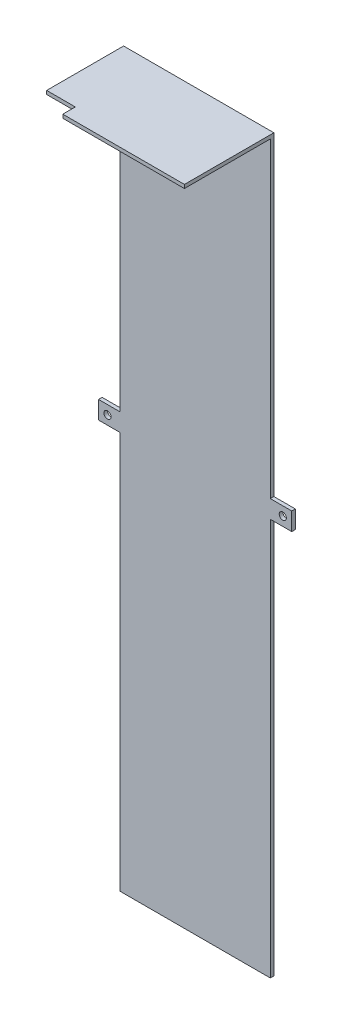
ISO-10303-21;
HEADER;
FILE_DESCRIPTION(('STEP AP214'),'2;1');
FILE_NAME('part.step','',(''),(''),'','','');
FILE_SCHEMA(('AUTOMOTIVE_DESIGN { 1 0 10303 214 1 1 1 1 }'));
ENDSEC;
DATA;
#1=APPLICATION_CONTEXT('core data for automotive mechanical design processes');
#2=APPLICATION_PROTOCOL_DEFINITION('international standard','automotive_design',2000,#1);
#3=PRODUCT_CONTEXT('',#1,'mechanical');
#4=PRODUCT('Part','Part','',(#3));
#5=PRODUCT_RELATED_PRODUCT_CATEGORY('part','',(#4));
#6=PRODUCT_DEFINITION_FORMATION('','',#4);
#7=PRODUCT_DEFINITION_CONTEXT('part definition',#1,'design');
#8=PRODUCT_DEFINITION('design','',#6,#7);
#9=PRODUCT_DEFINITION_SHAPE('','',#8);
#10=(LENGTH_UNIT() NAMED_UNIT(*) SI_UNIT(.MILLI.,.METRE.));
#11=(NAMED_UNIT(*) PLANE_ANGLE_UNIT() SI_UNIT($,.RADIAN.));
#12=(NAMED_UNIT(*) SI_UNIT($,.STERADIAN.) SOLID_ANGLE_UNIT());
#13=UNCERTAINTY_MEASURE_WITH_UNIT(LENGTH_MEASURE(1.E-05),#10,'distance_accuracy_value','');
#14=(GEOMETRIC_REPRESENTATION_CONTEXT(3) GLOBAL_UNCERTAINTY_ASSIGNED_CONTEXT((#13)) GLOBAL_UNIT_ASSIGNED_CONTEXT((#10,
#11,#12)) REPRESENTATION_CONTEXT('',''));
#15=CARTESIAN_POINT('',(0.,0.,0.));
#16=DIRECTION('',(0.,0.,1.));
#17=DIRECTION('',(1.,0.,0.));
#18=AXIS2_PLACEMENT_3D('',#15,#16,#17);
#19=CARTESIAN_POINT('',(-16.6842105263158,1.,-5.73684210526316));
#20=DIRECTION('',(1.,0.,0.));
#21=DIRECTION('',(0.,0.,-1.));
#22=AXIS2_PLACEMENT_3D('',#19,#20,#21);
#23=PLANE('',#22);
#24=DIRECTION('',(0.,-1.,0.));
#25=VECTOR('',#24,1.);
#26=CARTESIAN_POINT('',(-16.6842105263158,1.,-5.73684210526316));
#27=LINE('',#26,#25);
#28=CARTESIAN_POINT('',(-16.6842105263158,1.,-5.73684210526316));
#29=VERTEX_POINT('',#28);
#30=CARTESIAN_POINT('',(-16.6842105263158,-87.05,-5.73684210526316));
#31=VERTEX_POINT('',#30);
#32=EDGE_CURVE('E163',#29,#31,#27,.T.);
#33=ORIENTED_EDGE('',*,*,#32,.T.);
#34=DIRECTION('',(0.,0.,1.));
#35=VECTOR('',#34,1.);
#36=CARTESIAN_POINT('',(-16.6842105263158,-87.05,-5.73684210526316));
#37=LINE('',#36,#35);
#38=CARTESIAN_POINT('',(-16.6842105263158,-87.05,-4.73684210526315));
#39=VERTEX_POINT('',#38);
#40=EDGE_CURVE('E59',#31,#39,#37,.T.);
#41=ORIENTED_EDGE('',*,*,#40,.T.);
#42=DIRECTION('',(0.,1.,0.));
#43=VECTOR('',#42,1.);
#44=CARTESIAN_POINT('',(-16.6842105263158,-178.,-4.73684210526315));
#45=LINE('',#44,#43);
#46=CARTESIAN_POINT('',(-16.6842105263158,0.,-4.73684210526315));
#47=VERTEX_POINT('',#46);
#48=EDGE_CURVE('E287',#39,#47,#45,.T.);
#49=ORIENTED_EDGE('',*,*,#48,.T.);
#50=DIRECTION('',(0.,0.,1.));
#51=VECTOR('',#50,1.);
#52=CARTESIAN_POINT('',(-16.6842105263158,0.,-5.73684210526316));
#53=LINE('',#52,#51);
#54=CARTESIAN_POINT('',(-16.6842105263158,0.,15.7631578947368));
#55=VERTEX_POINT('',#54);
#56=EDGE_CURVE('E297',#47,#55,#53,.T.);
#57=ORIENTED_EDGE('',*,*,#56,.T.);
#58=DIRECTION('',(0.,1.,0.));
#59=VECTOR('',#58,1.);
#60=CARTESIAN_POINT('',(-16.6842105263158,-14.,15.7631578947368));
#61=LINE('',#60,#59);
#62=CARTESIAN_POINT('',(-16.6842105263158,1.,15.7631578947368));
#63=VERTEX_POINT('',#62);
#64=EDGE_CURVE('E283',#55,#63,#61,.T.);
#65=ORIENTED_EDGE('',*,*,#64,.T.);
#66=DIRECTION('',(0.,0.,1.));
#67=VECTOR('',#66,1.);
#68=CARTESIAN_POINT('',(-16.6842105263158,1.,-5.73684210526316));
#69=LINE('',#68,#67);
#70=EDGE_CURVE('E301',#29,#63,#69,.T.);
#71=ORIENTED_EDGE('',*,*,#70,.F.);
#72=EDGE_LOOP('',(#33,#41,#49,#57,#65,#71));
#73=FACE_BOUND('',#72,.T.);
#74=ADVANCED_FACE('F43',(#73),#23,.F.);
#75=CARTESIAN_POINT('',(25.3157894736842,1.,-5.73684210526316));
#76=DIRECTION('',(-1.,0.,0.));
#77=DIRECTION('',(0.,0.,1.));
#78=AXIS2_PLACEMENT_3D('',#75,#76,#77);
#79=PLANE('',#78);
#80=DIRECTION('',(0.,0.,-1.));
#81=VECTOR('',#80,1.);
#82=CARTESIAN_POINT('',(25.3157894736842,-92.05,-4.73684210526316));
#83=LINE('',#82,#81);
#84=CARTESIAN_POINT('',(25.3157894736842,-92.05,-4.73684210526316));
#85=VERTEX_POINT('',#84);
#86=CARTESIAN_POINT('',(25.3157894736842,-92.05,-5.73684210526316));
#87=VERTEX_POINT('',#86);
#88=EDGE_CURVE('E263',#85,#87,#83,.T.);
#89=ORIENTED_EDGE('',*,*,#88,.F.);
#90=DIRECTION('',(0.,1.,0.));
#91=VECTOR('',#90,1.);
#92=CARTESIAN_POINT('',(25.3157894736842,-178.,-4.73684210526316));
#93=LINE('',#92,#91);
#94=CARTESIAN_POINT('',(25.3157894736842,-203.1,-4.73684210526315));
#95=VERTEX_POINT('',#94);
#96=EDGE_CURVE('E293',#95,#85,#93,.T.);
#97=ORIENTED_EDGE('',*,*,#96,.F.);
#98=DIRECTION('',(0.,0.,1.));
#99=VECTOR('',#98,1.);
#100=CARTESIAN_POINT('',(25.3157894736842,-203.1,-5.73684210526316));
#101=LINE('',#100,#99);
#102=CARTESIAN_POINT('',(25.3157894736842,-203.1,-5.73684210526316));
#103=VERTEX_POINT('',#102);
#104=EDGE_CURVE('E177',#103,#95,#101,.T.);
#105=ORIENTED_EDGE('',*,*,#104,.F.);
#106=DIRECTION('',(0.,-1.,0.));
#107=VECTOR('',#106,1.);
#108=CARTESIAN_POINT('',(25.3157894736842,1.,-5.73684210526316));
#109=LINE('',#108,#107);
#110=EDGE_CURVE('E172',#87,#103,#109,.T.);
#111=ORIENTED_EDGE('',*,*,#110,.F.);
#112=EDGE_LOOP('',(#89,#97,#105,#111));
#113=FACE_BOUND('',#112,.T.);
#114=ADVANCED_FACE('F383',(#113),#79,.F.);
#115=CARTESIAN_POINT('',(25.3157894736842,-178.,-4.73684210526316));
#116=DIRECTION('',(0.,0.,1.));
#117=DIRECTION('',(1.,0.,0.));
#118=AXIS2_PLACEMENT_3D('',#115,#116,#117);
#119=PLANE('',#118);
#120=DIRECTION('',(-1.,0.,0.));
#121=VECTOR('',#120,1.);
#122=CARTESIAN_POINT('',(-16.6842105263158,-203.1,-4.73684210526315));
#123=LINE('',#122,#121);
#124=CARTESIAN_POINT('',(-16.6842105263158,-203.1,-4.73684210526315));
#125=VERTEX_POINT('',#124);
#126=EDGE_CURVE('E182',#95,#125,#123,.T.);
#127=ORIENTED_EDGE('',*,*,#126,.F.);
#128=ORIENTED_EDGE('',*,*,#96,.T.);
#129=DIRECTION('',(-1.,0.,0.));
#130=VECTOR('',#129,1.);
#131=CARTESIAN_POINT('',(25.3157894736842,-92.05,-4.73684210526316));
#132=LINE('',#131,#130);
#133=CARTESIAN_POINT('',(31.3157894736842,-92.05,-4.73684210526316));
#134=VERTEX_POINT('',#133);
#135=EDGE_CURVE('E250',#134,#85,#132,.T.);
#136=ORIENTED_EDGE('',*,*,#135,.F.);
#137=DIRECTION('',(0.,-1.,0.));
#138=VECTOR('',#137,1.);
#139=CARTESIAN_POINT('',(31.3157894736842,-92.05,-4.73684210526316));
#140=LINE('',#139,#138);
#141=CARTESIAN_POINT('',(31.3157894736842,-87.05,-4.73684210526316));
#142=VERTEX_POINT('',#141);
#143=EDGE_CURVE('E245',#142,#134,#140,.T.);
#144=ORIENTED_EDGE('',*,*,#143,.F.);
#145=DIRECTION('',(1.,0.,0.));
#146=VECTOR('',#145,1.);
#147=CARTESIAN_POINT('',(25.3157894736842,-87.05,-4.73684210526316));
#148=LINE('',#147,#146);
#149=CARTESIAN_POINT('',(25.3157894736842,-87.05,-4.73684210526316));
#150=VERTEX_POINT('',#149);
#151=EDGE_CURVE('E241',#150,#142,#148,.T.);
#152=ORIENTED_EDGE('',*,*,#151,.F.);
#153=CARTESIAN_POINT('',(25.3157894736842,0.,-4.73684210526316));
#154=VERTEX_POINT('',#153);
#155=EDGE_CURVE('E298',#150,#154,#93,.T.);
#156=ORIENTED_EDGE('',*,*,#155,.T.);
#157=DIRECTION('',(1.,0.,0.));
#158=VECTOR('',#157,1.);
#159=CARTESIAN_POINT('',(0.,0.,-4.73684210526315));
#160=LINE('',#159,#158);
#161=EDGE_CURVE('E332',#47,#154,#160,.T.);
#162=ORIENTED_EDGE('',*,*,#161,.F.);
#163=ORIENTED_EDGE('',*,*,#48,.F.);
#164=DIRECTION('',(1.,0.,0.));
#165=VECTOR('',#164,1.);
#166=CARTESIAN_POINT('',(31.3157894736842,-87.05,-4.73684210526316));
#167=LINE('',#166,#165);
#168=CARTESIAN_POINT('',(-22.6842105263158,-87.05,-4.73684210526315));
#169=VERTEX_POINT('',#168);
#170=EDGE_CURVE('E226',#169,#39,#167,.T.);
#171=ORIENTED_EDGE('',*,*,#170,.F.);
#172=DIRECTION('',(0.,1.,0.));
#173=VECTOR('',#172,1.);
#174=CARTESIAN_POINT('',(-22.6842105263158,-87.05,-4.73684210526315));
#175=LINE('',#174,#173);
#176=CARTESIAN_POINT('',(-22.6842105263158,-92.05,-4.73684210526315));
#177=VERTEX_POINT('',#176);
#178=EDGE_CURVE('E206',#177,#169,#175,.T.);
#179=ORIENTED_EDGE('',*,*,#178,.F.);
#180=DIRECTION('',(-1.,0.,0.));
#181=VECTOR('',#180,1.);
#182=CARTESIAN_POINT('',(31.3157894736842,-92.05,-4.73684210526316));
#183=LINE('',#182,#181);
#184=CARTESIAN_POINT('',(-16.6842105263158,-92.05,-4.73684210526315));
#185=VERTEX_POINT('',#184);
#186=EDGE_CURVE('E223',#185,#177,#183,.T.);
#187=ORIENTED_EDGE('',*,*,#186,.F.);
#188=EDGE_CURVE('E67',#125,#185,#45,.T.);
#189=ORIENTED_EDGE('',*,*,#188,.F.);
#190=EDGE_LOOP('',(#127,#128,#136,#144,#152,#156,#162,#163,#171,#179,#187,#189));
#191=FACE_BOUND('',#190,.T.);
#192=CARTESIAN_POINT('',(-20.1842105263158,-89.55,-4.73684210526316));
#193=DIRECTION('',(0.,0.,-1.));
#194=DIRECTION('',(-1.,0.,0.));
#195=AXIS2_PLACEMENT_3D('',#192,#193,#194);
#196=CIRCLE('',#195,1.);
#197=CARTESIAN_POINT('',(-21.1842105263158,-89.55,-4.73684210526316));
#198=VERTEX_POINT('',#197);
#199=EDGE_CURVE('E191',#198,#198,#196,.T.);
#200=ORIENTED_EDGE('',*,*,#199,.T.);
#201=EDGE_LOOP('',(#200));
#202=FACE_BOUND('',#201,.T.);
#203=CARTESIAN_POINT('',(28.8157894736842,-89.55,-4.73684210526316));
#204=DIRECTION('',(0.,0.,-1.));
#205=DIRECTION('',(-1.,0.,0.));
#206=AXIS2_PLACEMENT_3D('',#203,#204,#205);
#207=CIRCLE('',#206,1.);
#208=CARTESIAN_POINT('',(27.8157894736842,-89.55,-4.73684210526316));
#209=VERTEX_POINT('',#208);
#210=EDGE_CURVE('E215',#209,#209,#207,.T.);
#211=ORIENTED_EDGE('',*,*,#210,.T.);
#212=EDGE_LOOP('',(#211));
#213=FACE_BOUND('',#212,.T.);
#214=ADVANCED_FACE('F371',(#191,#202,#213),#119,.T.);
#215=ORIENTED_EDGE('',*,*,#188,.T.);
#216=DIRECTION('',(0.,0.,-1.));
#217=VECTOR('',#216,1.);
#218=CARTESIAN_POINT('',(-16.6842105263158,-92.05,-5.73684210526316));
#219=LINE('',#218,#217);
#220=CARTESIAN_POINT('',(-16.6842105263158,-92.05,-5.73684210526316));
#221=VERTEX_POINT('',#220);
#222=EDGE_CURVE('E159',#185,#221,#219,.T.);
#223=ORIENTED_EDGE('',*,*,#222,.T.);
#224=CARTESIAN_POINT('',(-16.6842105263158,-203.1,-5.73684210526316));
#225=VERTEX_POINT('',#224);
#226=EDGE_CURVE('E155',#221,#225,#27,.T.);
#227=ORIENTED_EDGE('',*,*,#226,.T.);
#228=DIRECTION('',(0.,0.,-1.));
#229=VECTOR('',#228,1.);
#230=CARTESIAN_POINT('',(-16.6842105263158,-203.1,-5.73684210526316));
#231=LINE('',#230,#229);
#232=EDGE_CURVE('E158',#125,#225,#231,.T.);
#233=ORIENTED_EDGE('',*,*,#232,.F.);
#234=EDGE_LOOP('',(#215,#223,#227,#233));
#235=FACE_BOUND('',#234,.T.);
#236=ADVANCED_FACE('F45',(#235),#23,.F.);
#237=ORIENTED_EDGE('',*,*,#155,.F.);
#238=DIRECTION('',(0.,0.,-1.));
#239=VECTOR('',#238,1.);
#240=CARTESIAN_POINT('',(25.3157894736842,-87.05,-4.73684210526316));
#241=LINE('',#240,#239);
#242=CARTESIAN_POINT('',(25.3157894736842,-87.05,-5.73684210526316));
#243=VERTEX_POINT('',#242);
#244=EDGE_CURVE('E253',#150,#243,#241,.T.);
#245=ORIENTED_EDGE('',*,*,#244,.T.);
#246=CARTESIAN_POINT('',(25.3157894736842,1.,-5.73684210526316));
#247=VERTEX_POINT('',#246);
#248=EDGE_CURVE('E324',#247,#243,#109,.T.);
#249=ORIENTED_EDGE('',*,*,#248,.F.);
#250=DIRECTION('',(0.,0.,-1.));
#251=VECTOR('',#250,1.);
#252=CARTESIAN_POINT('',(25.3157894736842,1.,-5.73684210526316));
#253=LINE('',#252,#251);
#254=CARTESIAN_POINT('',(25.3157894736842,1.,19.2631578947368));
#255=VERTEX_POINT('',#254);
#256=EDGE_CURVE('E309',#255,#247,#253,.T.);
#257=ORIENTED_EDGE('',*,*,#256,.F.);
#258=DIRECTION('',(0.,-1.,0.));
#259=VECTOR('',#258,1.);
#260=CARTESIAN_POINT('',(25.3157894736842,1.,19.2631578947368));
#261=LINE('',#260,#259);
#262=CARTESIAN_POINT('',(25.3157894736842,0.,19.2631578947368));
#263=VERTEX_POINT('',#262);
#264=EDGE_CURVE('E328',#255,#263,#261,.T.);
#265=ORIENTED_EDGE('',*,*,#264,.T.);
#266=DIRECTION('',(0.,0.,-1.));
#267=VECTOR('',#266,1.);
#268=CARTESIAN_POINT('',(25.3157894736842,0.,-5.73684210526316));
#269=LINE('',#268,#267);
#270=EDGE_CURVE('E306',#263,#154,#269,.T.);
#271=ORIENTED_EDGE('',*,*,#270,.T.);
#272=EDGE_LOOP('',(#237,#245,#249,#257,#265,#271));
#273=FACE_BOUND('',#272,.T.);
#274=ADVANCED_FACE('F363',(#273),#79,.F.);
#275=CARTESIAN_POINT('',(-16.6842105263158,1.,-5.73684210526316));
#276=DIRECTION('',(0.,0.,1.));
#277=DIRECTION('',(1.,0.,0.));
#278=AXIS2_PLACEMENT_3D('',#275,#276,#277);
#279=PLANE('',#278);
#280=ORIENTED_EDGE('',*,*,#110,.T.);
#281=DIRECTION('',(1.,0.,0.));
#282=VECTOR('',#281,1.);
#283=CARTESIAN_POINT('',(-16.6842105263158,-203.1,-5.73684210526316));
#284=LINE('',#283,#282);
#285=EDGE_CURVE('E167',#225,#103,#284,.T.);
#286=ORIENTED_EDGE('',*,*,#285,.F.);
#287=ORIENTED_EDGE('',*,*,#226,.F.);
#288=DIRECTION('',(-1.,0.,0.));
#289=VECTOR('',#288,1.);
#290=CARTESIAN_POINT('',(31.3157894736842,-92.05,-5.73684210526316));
#291=LINE('',#290,#289);
#292=CARTESIAN_POINT('',(-22.6842105263158,-92.05,-5.73684210526316));
#293=VERTEX_POINT('',#292);
#294=EDGE_CURVE('E219',#221,#293,#291,.T.);
#295=ORIENTED_EDGE('',*,*,#294,.T.);
#296=DIRECTION('',(0.,-1.,0.));
#297=VECTOR('',#296,1.);
#298=CARTESIAN_POINT('',(-22.6842105263158,-87.05,-5.73684210526316));
#299=LINE('',#298,#297);
#300=CARTESIAN_POINT('',(-22.6842105263158,-87.05,-5.73684210526316));
#301=VERTEX_POINT('',#300);
#302=EDGE_CURVE('E195',#301,#293,#299,.T.);
#303=ORIENTED_EDGE('',*,*,#302,.F.);
#304=DIRECTION('',(1.,0.,0.));
#305=VECTOR('',#304,1.);
#306=CARTESIAN_POINT('',(31.3157894736842,-87.05,-5.73684210526316));
#307=LINE('',#306,#305);
#308=EDGE_CURVE('E227',#301,#31,#307,.T.);
#309=ORIENTED_EDGE('',*,*,#308,.T.);
#310=ORIENTED_EDGE('',*,*,#32,.F.);
#311=DIRECTION('',(-1.,0.,0.));
#312=VECTOR('',#311,1.);
#313=CARTESIAN_POINT('',(-16.6842105263158,1.,-5.73684210526316));
#314=LINE('',#313,#312);
#315=EDGE_CURVE('E164',#247,#29,#314,.T.);
#316=ORIENTED_EDGE('',*,*,#315,.F.);
#317=ORIENTED_EDGE('',*,*,#248,.T.);
#318=DIRECTION('',(1.,0.,0.));
#319=VECTOR('',#318,1.);
#320=CARTESIAN_POINT('',(25.3157894736842,-87.05,-5.73684210526316));
#321=LINE('',#320,#319);
#322=CARTESIAN_POINT('',(31.3157894736842,-87.05,-5.73684210526316));
#323=VERTEX_POINT('',#322);
#324=EDGE_CURVE('E240',#243,#323,#321,.T.);
#325=ORIENTED_EDGE('',*,*,#324,.T.);
#326=DIRECTION('',(0.,-1.,0.));
#327=VECTOR('',#326,1.);
#328=CARTESIAN_POINT('',(31.3157894736842,-92.05,-5.73684210526316));
#329=LINE('',#328,#327);
#330=CARTESIAN_POINT('',(31.3157894736842,-92.05,-5.73684210526316));
#331=VERTEX_POINT('',#330);
#332=EDGE_CURVE('E257',#323,#331,#329,.T.);
#333=ORIENTED_EDGE('',*,*,#332,.T.);
#334=DIRECTION('',(-1.,0.,0.));
#335=VECTOR('',#334,1.);
#336=CARTESIAN_POINT('',(25.3157894736842,-92.05,-5.73684210526316));
#337=LINE('',#336,#335);
#338=EDGE_CURVE('E246',#331,#87,#337,.T.);
#339=ORIENTED_EDGE('',*,*,#338,.T.);
#340=EDGE_LOOP('',(#280,#286,#287,#295,#303,#309,#310,#316,#317,#325,#333,#339));
#341=FACE_BOUND('',#340,.T.);
#342=CARTESIAN_POINT('',(-20.1842105263158,-89.55,-5.73684210526316));
#343=DIRECTION('',(0.,0.,-1.));
#344=DIRECTION('',(-1.,0.,0.));
#345=AXIS2_PLACEMENT_3D('',#342,#343,#344);
#346=CIRCLE('',#345,1.);
#347=CARTESIAN_POINT('',(-21.1842105263158,-89.55,-5.73684210526316));
#348=VERTEX_POINT('',#347);
#349=EDGE_CURVE('E190',#348,#348,#346,.T.);
#350=ORIENTED_EDGE('',*,*,#349,.F.);
#351=EDGE_LOOP('',(#350));
#352=FACE_BOUND('',#351,.T.);
#353=CARTESIAN_POINT('',(28.8157894736842,-89.55,-5.73684210526316));
#354=DIRECTION('',(0.,0.,-1.));
#355=DIRECTION('',(-1.,0.,0.));
#356=AXIS2_PLACEMENT_3D('',#353,#354,#355);
#357=CIRCLE('',#356,1.);
#358=CARTESIAN_POINT('',(27.8157894736842,-89.55,-5.73684210526316));
#359=VERTEX_POINT('',#358);
#360=EDGE_CURVE('E214',#359,#359,#357,.T.);
#361=ORIENTED_EDGE('',*,*,#360,.F.);
#362=EDGE_LOOP('',(#361));
#363=FACE_BOUND('',#362,.T.);
#364=ADVANCED_FACE('F168',(#341,#352,#363),#279,.F.);
#365=CARTESIAN_POINT('',(-16.6842105263158,1.,19.2631578947368));
#366=DIRECTION('',(0.,0.,-1.));
#367=DIRECTION('',(-1.,0.,0.));
#368=AXIS2_PLACEMENT_3D('',#365,#366,#367);
#369=PLANE('',#368);
#370=DIRECTION('',(1.,0.,0.));
#371=VECTOR('',#370,1.);
#372=CARTESIAN_POINT('',(-16.6842105263158,1.,19.2631578947368));
#373=LINE('',#372,#371);
#374=CARTESIAN_POINT('',(-8.68421052631578,1.,19.2631578947368));
#375=VERTEX_POINT('',#374);
#376=EDGE_CURVE('E305',#375,#255,#373,.T.);
#377=ORIENTED_EDGE('',*,*,#376,.F.);
#378=DIRECTION('',(0.,1.,0.));
#379=VECTOR('',#378,1.);
#380=CARTESIAN_POINT('',(-8.68421052631578,-14.,19.2631578947368));
#381=LINE('',#380,#379);
#382=CARTESIAN_POINT('',(-8.68421052631578,0.,19.2631578947368));
#383=VERTEX_POINT('',#382);
#384=EDGE_CURVE('E282',#383,#375,#381,.T.);
#385=ORIENTED_EDGE('',*,*,#384,.F.);
#386=DIRECTION('',(1.,0.,0.));
#387=VECTOR('',#386,1.);
#388=CARTESIAN_POINT('',(-16.6842105263158,0.,19.2631578947368));
#389=LINE('',#388,#387);
#390=EDGE_CURVE('E317',#383,#263,#389,.T.);
#391=ORIENTED_EDGE('',*,*,#390,.T.);
#392=ORIENTED_EDGE('',*,*,#264,.F.);
#393=EDGE_LOOP('',(#377,#385,#391,#392));
#394=FACE_BOUND('',#393,.T.);
#395=ADVANCED_FACE('F349',(#394),#369,.F.);
#396=CARTESIAN_POINT('',(0.,1.,0.));
#397=DIRECTION('',(0.,1.,0.));
#398=DIRECTION('',(0.,0.,1.));
#399=AXIS2_PLACEMENT_3D('',#396,#397,#398);
#400=PLANE('',#399);
#401=DIRECTION('',(-1.,0.,0.));
#402=VECTOR('',#401,1.);
#403=CARTESIAN_POINT('',(-16.6842105263158,1.,15.7631578947368));
#404=LINE('',#403,#402);
#405=CARTESIAN_POINT('',(-8.68421052631578,1.,15.7631578947368));
#406=VERTEX_POINT('',#405);
#407=EDGE_CURVE('E279',#406,#63,#404,.T.);
#408=ORIENTED_EDGE('',*,*,#407,.F.);
#409=DIRECTION('',(0.,0.,-1.));
#410=VECTOR('',#409,1.);
#411=CARTESIAN_POINT('',(-8.68421052631578,1.,19.2631578947368));
#412=LINE('',#411,#410);
#413=EDGE_CURVE('E266',#375,#406,#412,.T.);
#414=ORIENTED_EDGE('',*,*,#413,.F.);
#415=ORIENTED_EDGE('',*,*,#376,.T.);
#416=ORIENTED_EDGE('',*,*,#256,.T.);
#417=ORIENTED_EDGE('',*,*,#315,.T.);
#418=ORIENTED_EDGE('',*,*,#70,.T.);
#419=EDGE_LOOP('',(#408,#414,#415,#416,#417,#418));
#420=FACE_BOUND('',#419,.T.);
#421=ADVANCED_FACE('F354',(#420),#400,.T.);
#422=CARTESIAN_POINT('',(0.,0.,0.));
#423=DIRECTION('',(0.,1.,0.));
#424=DIRECTION('',(0.,0.,1.));
#425=AXIS2_PLACEMENT_3D('',#422,#423,#424);
#426=PLANE('',#425);
#427=DIRECTION('',(0.,0.,-1.));
#428=VECTOR('',#427,1.);
#429=CARTESIAN_POINT('',(-8.68421052631578,0.,0.));
#430=LINE('',#429,#428);
#431=CARTESIAN_POINT('',(-8.68421052631578,0.,15.7631578947368));
#432=VERTEX_POINT('',#431);
#433=EDGE_CURVE('E52',#383,#432,#430,.T.);
#434=ORIENTED_EDGE('',*,*,#433,.T.);
#435=DIRECTION('',(-1.,0.,0.));
#436=VECTOR('',#435,1.);
#437=CARTESIAN_POINT('',(0.,0.,15.7631578947368));
#438=LINE('',#437,#436);
#439=EDGE_CURVE('E11',#432,#55,#438,.T.);
#440=ORIENTED_EDGE('',*,*,#439,.T.);
#441=ORIENTED_EDGE('',*,*,#56,.F.);
#442=ORIENTED_EDGE('',*,*,#161,.T.);
#443=ORIENTED_EDGE('',*,*,#270,.F.);
#444=ORIENTED_EDGE('',*,*,#390,.F.);
#445=EDGE_LOOP('',(#434,#440,#441,#442,#443,#444));
#446=FACE_BOUND('',#445,.T.);
#447=ADVANCED_FACE('F339',(#446),#426,.F.);
#448=CARTESIAN_POINT('',(-16.6842105263158,-14.,15.7631578947368));
#449=DIRECTION('',(0.,0.,-1.));
#450=DIRECTION('',(-1.,0.,0.));
#451=AXIS2_PLACEMENT_3D('',#448,#449,#450);
#452=PLANE('',#451);
#453=DIRECTION('',(0.,1.,0.));
#454=VECTOR('',#453,1.);
#455=CARTESIAN_POINT('',(-8.68421052631578,-14.,15.7631578947368));
#456=LINE('',#455,#454);
#457=EDGE_CURVE('E288',#432,#406,#456,.T.);
#458=ORIENTED_EDGE('',*,*,#457,.T.);
#459=ORIENTED_EDGE('',*,*,#407,.T.);
#460=ORIENTED_EDGE('',*,*,#64,.F.);
#461=ORIENTED_EDGE('',*,*,#439,.F.);
#462=EDGE_LOOP('',(#458,#459,#460,#461));
#463=FACE_BOUND('',#462,.T.);
#464=ADVANCED_FACE('F358',(#463),#452,.F.);
#465=CARTESIAN_POINT('',(-8.68421052631578,-14.,19.2631578947368));
#466=DIRECTION('',(1.,0.,0.));
#467=DIRECTION('',(0.,0.,-1.));
#468=AXIS2_PLACEMENT_3D('',#465,#466,#467);
#469=PLANE('',#468);
#470=ORIENTED_EDGE('',*,*,#384,.T.);
#471=ORIENTED_EDGE('',*,*,#413,.T.);
#472=ORIENTED_EDGE('',*,*,#457,.F.);
#473=ORIENTED_EDGE('',*,*,#433,.F.);
#474=EDGE_LOOP('',(#470,#471,#472,#473));
#475=FACE_BOUND('',#474,.T.);
#476=ADVANCED_FACE('F345',(#475),#469,.F.);
#477=CARTESIAN_POINT('',(25.3157894736842,-92.05,-4.73684210526316));
#478=DIRECTION('',(0.,-1.,0.));
#479=DIRECTION('',(0.,0.,-1.));
#480=AXIS2_PLACEMENT_3D('',#477,#478,#479);
#481=PLANE('',#480);
#482=ORIENTED_EDGE('',*,*,#338,.F.);
#483=DIRECTION('',(0.,0.,-1.));
#484=VECTOR('',#483,1.);
#485=CARTESIAN_POINT('',(31.3157894736842,-92.05,-4.73684210526316));
#486=LINE('',#485,#484);
#487=EDGE_CURVE('E267',#134,#331,#486,.T.);
#488=ORIENTED_EDGE('',*,*,#487,.F.);
#489=ORIENTED_EDGE('',*,*,#135,.T.);
#490=ORIENTED_EDGE('',*,*,#88,.T.);
#491=EDGE_LOOP('',(#482,#488,#489,#490));
#492=FACE_BOUND('',#491,.T.);
#493=ADVANCED_FACE('F386',(#492),#481,.T.);
#494=CARTESIAN_POINT('',(31.3157894736842,-92.05,-4.73684210526316));
#495=DIRECTION('',(1.,0.,0.));
#496=DIRECTION('',(0.,0.,-1.));
#497=AXIS2_PLACEMENT_3D('',#494,#495,#496);
#498=PLANE('',#497);
#499=ORIENTED_EDGE('',*,*,#332,.F.);
#500=DIRECTION('',(0.,0.,-1.));
#501=VECTOR('',#500,1.);
#502=CARTESIAN_POINT('',(31.3157894736842,-87.05,-4.73684210526316));
#503=LINE('',#502,#501);
#504=EDGE_CURVE('E270',#142,#323,#503,.T.);
#505=ORIENTED_EDGE('',*,*,#504,.F.);
#506=ORIENTED_EDGE('',*,*,#143,.T.);
#507=ORIENTED_EDGE('',*,*,#487,.T.);
#508=EDGE_LOOP('',(#499,#505,#506,#507));
#509=FACE_BOUND('',#508,.T.);
#510=ADVANCED_FACE('F389',(#509),#498,.T.);
#511=CARTESIAN_POINT('',(25.3157894736842,-87.05,-4.73684210526316));
#512=DIRECTION('',(0.,1.,0.));
#513=DIRECTION('',(0.,0.,1.));
#514=AXIS2_PLACEMENT_3D('',#511,#512,#513);
#515=PLANE('',#514);
#516=ORIENTED_EDGE('',*,*,#324,.F.);
#517=ORIENTED_EDGE('',*,*,#244,.F.);
#518=ORIENTED_EDGE('',*,*,#151,.T.);
#519=ORIENTED_EDGE('',*,*,#504,.T.);
#520=EDGE_LOOP('',(#516,#517,#518,#519));
#521=FACE_BOUND('',#520,.T.);
#522=ADVANCED_FACE('F392',(#521),#515,.T.);
#523=CARTESIAN_POINT('',(31.3157894736842,-87.05,-4.73684210526316));
#524=DIRECTION('',(0.,1.,0.));
#525=DIRECTION('',(0.,0.,1.));
#526=AXIS2_PLACEMENT_3D('',#523,#524,#525);
#527=PLANE('',#526);
#528=ORIENTED_EDGE('',*,*,#40,.F.);
#529=ORIENTED_EDGE('',*,*,#308,.F.);
#530=DIRECTION('',(0.,0.,-1.));
#531=VECTOR('',#530,1.);
#532=CARTESIAN_POINT('',(-22.6842105263158,-87.05,-5.73684210526316));
#533=LINE('',#532,#531);
#534=EDGE_CURVE('E210',#169,#301,#533,.T.);
#535=ORIENTED_EDGE('',*,*,#534,.F.);
#536=ORIENTED_EDGE('',*,*,#170,.T.);
#537=EDGE_LOOP('',(#528,#529,#535,#536));
#538=FACE_BOUND('',#537,.T.);
#539=ADVANCED_FACE('F368',(#538),#527,.T.);
#540=CARTESIAN_POINT('',(31.3157894736842,-92.05,-4.73684210526316));
#541=DIRECTION('',(0.,-1.,0.));
#542=DIRECTION('',(0.,0.,-1.));
#543=AXIS2_PLACEMENT_3D('',#540,#541,#542);
#544=PLANE('',#543);
#545=ORIENTED_EDGE('',*,*,#222,.F.);
#546=ORIENTED_EDGE('',*,*,#186,.T.);
#547=DIRECTION('',(0.,0.,1.));
#548=VECTOR('',#547,1.);
#549=CARTESIAN_POINT('',(-22.6842105263158,-92.05,-5.73684210526316));
#550=LINE('',#549,#548);
#551=EDGE_CURVE('E202',#293,#177,#550,.T.);
#552=ORIENTED_EDGE('',*,*,#551,.F.);
#553=ORIENTED_EDGE('',*,*,#294,.F.);
#554=EDGE_LOOP('',(#545,#546,#552,#553));
#555=FACE_BOUND('',#554,.T.);
#556=ADVANCED_FACE('F378',(#555),#544,.T.);
#557=CARTESIAN_POINT('',(28.8157894736842,-89.55,-4.73684210526316));
#558=DIRECTION('',(0.,0.,-1.));
#559=DIRECTION('',(-1.,0.,0.));
#560=AXIS2_PLACEMENT_3D('',#557,#558,#559);
#561=CYLINDRICAL_SURFACE('',#560,1.);
#562=ORIENTED_EDGE('',*,*,#210,.F.);
#563=EDGE_LOOP('',(#562));
#564=FACE_BOUND('',#563,.T.);
#565=ORIENTED_EDGE('',*,*,#360,.T.);
#566=EDGE_LOOP('',(#565));
#567=FACE_BOUND('',#566,.T.);
#568=ADVANCED_FACE('F536',(#564,#567),#561,.F.);
#569=CARTESIAN_POINT('',(-22.6842105263158,0.,0.));
#570=DIRECTION('',(-1.,0.,0.));
#571=DIRECTION('',(0.,0.,1.));
#572=AXIS2_PLACEMENT_3D('',#569,#570,#571);
#573=PLANE('',#572);
#574=ORIENTED_EDGE('',*,*,#302,.T.);
#575=ORIENTED_EDGE('',*,*,#551,.T.);
#576=ORIENTED_EDGE('',*,*,#178,.T.);
#577=ORIENTED_EDGE('',*,*,#534,.T.);
#578=EDGE_LOOP('',(#574,#575,#576,#577));
#579=FACE_BOUND('',#578,.T.);
#580=ADVANCED_FACE('F375',(#579),#573,.T.);
#581=CARTESIAN_POINT('',(-20.1842105263158,-89.55,-4.73684210526316));
#582=DIRECTION('',(0.,0.,-1.));
#583=DIRECTION('',(-1.,0.,0.));
#584=AXIS2_PLACEMENT_3D('',#581,#582,#583);
#585=CYLINDRICAL_SURFACE('',#584,1.);
#586=ORIENTED_EDGE('',*,*,#199,.F.);
#587=EDGE_LOOP('',(#586));
#588=FACE_BOUND('',#587,.T.);
#589=ORIENTED_EDGE('',*,*,#349,.T.);
#590=EDGE_LOOP('',(#589));
#591=FACE_BOUND('',#590,.T.);
#592=ADVANCED_FACE('F561',(#588,#591),#585,.F.);
#593=CARTESIAN_POINT('',(0.,-203.1,0.));
#594=DIRECTION('',(0.,1.,0.));
#595=DIRECTION('',(0.,0.,1.));
#596=AXIS2_PLACEMENT_3D('',#593,#594,#595);
#597=PLANE('',#596);
#598=ORIENTED_EDGE('',*,*,#232,.T.);
#599=ORIENTED_EDGE('',*,*,#285,.T.);
#600=ORIENTED_EDGE('',*,*,#104,.T.);
#601=ORIENTED_EDGE('',*,*,#126,.T.);
#602=EDGE_LOOP('',(#598,#599,#600,#601));
#603=FACE_BOUND('',#602,.T.);
#604=ADVANCED_FACE('F180',(#603),#597,.F.);
#605=CLOSED_SHELL('',(#74,#114,#214,#236,#274,#364,#395,#421,#447,#464,#476,#493,#510,#522,#539,
#556,#568,#580,#592,#604));
#606=MANIFOLD_SOLID_BREP('B2',#605);
#607=ADVANCED_BREP_SHAPE_REPRESENTATION('',(#18,#606),#14);
#608=SHAPE_DEFINITION_REPRESENTATION(#9,#607);
ENDSEC;
END-ISO-10303-21;
